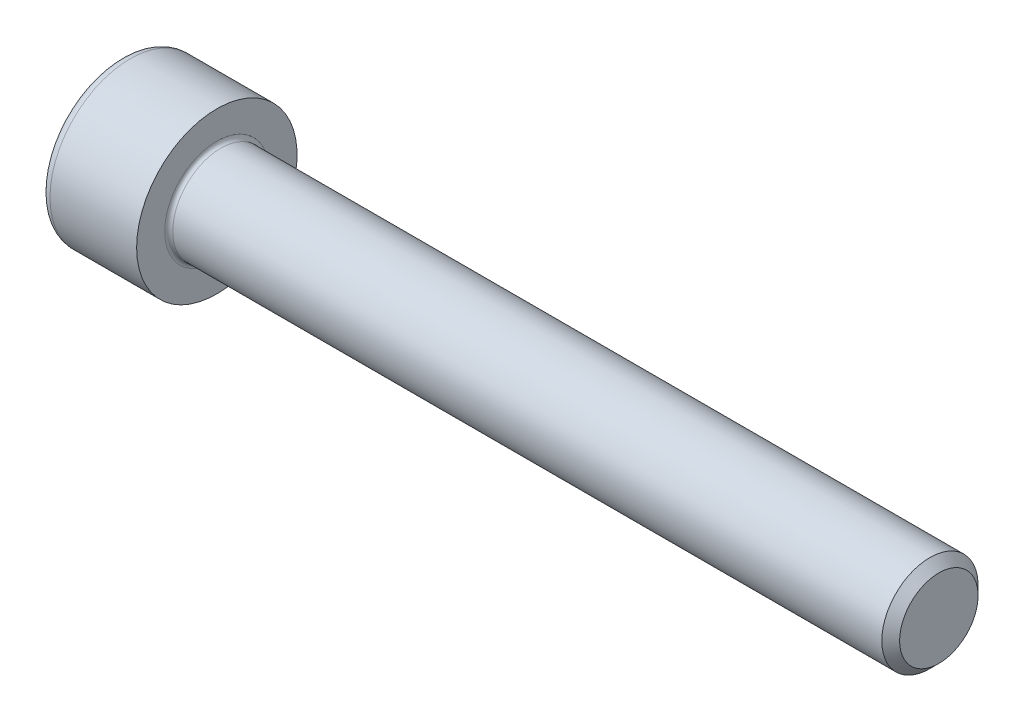
ISO-10303-21;
HEADER;
FILE_DESCRIPTION(('STEP AP214'),'2;1');
FILE_NAME('part.step','',(''),(''),'','','');
FILE_SCHEMA(('AUTOMOTIVE_DESIGN { 1 0 10303 214 1 1 1 1 }'));
ENDSEC;
DATA;
#1=APPLICATION_CONTEXT('core data for automotive mechanical design processes');
#2=APPLICATION_PROTOCOL_DEFINITION('international standard','automotive_design',2000,#1);
#3=PRODUCT_CONTEXT('',#1,'mechanical');
#4=PRODUCT('Part','Part','',(#3));
#5=PRODUCT_RELATED_PRODUCT_CATEGORY('part','',(#4));
#6=PRODUCT_DEFINITION_FORMATION('','',#4);
#7=PRODUCT_DEFINITION_CONTEXT('part definition',#1,'design');
#8=PRODUCT_DEFINITION('design','',#6,#7);
#9=PRODUCT_DEFINITION_SHAPE('','',#8);
#10=(LENGTH_UNIT() NAMED_UNIT(*) SI_UNIT(.MILLI.,.METRE.));
#11=(NAMED_UNIT(*) PLANE_ANGLE_UNIT() SI_UNIT($,.RADIAN.));
#12=(NAMED_UNIT(*) SI_UNIT($,.STERADIAN.) SOLID_ANGLE_UNIT());
#13=UNCERTAINTY_MEASURE_WITH_UNIT(LENGTH_MEASURE(1.E-05),#10,'distance_accuracy_value','');
#14=(GEOMETRIC_REPRESENTATION_CONTEXT(3) GLOBAL_UNCERTAINTY_ASSIGNED_CONTEXT((#13)) GLOBAL_UNIT_ASSIGNED_CONTEXT((#10,
#11,#12)) REPRESENTATION_CONTEXT('',''));
#15=CARTESIAN_POINT('',(0.,0.,0.));
#16=DIRECTION('',(0.,0.,1.));
#17=DIRECTION('',(1.,0.,0.));
#18=AXIS2_PLACEMENT_3D('',#15,#16,#17);
#19=CARTESIAN_POINT('',(0.,0.,0.));
#20=DIRECTION('',(-1.,0.,0.));
#21=DIRECTION('',(0.,0.,1.));
#22=AXIS2_PLACEMENT_3D('',#19,#20,#21);
#23=PLANE('',#22);
#24=DIRECTION('',(0.,-0.499999999999999,0.866025403784439));
#25=VECTOR('',#24,1.);
#26=CARTESIAN_POINT('',(0.,2.89829835133192,0.));
#27=LINE('',#26,#25);
#28=CARTESIAN_POINT('',(0.,2.89829835133192,0.));
#29=VERTEX_POINT('',#28);
#30=CARTESIAN_POINT('',(0.,1.44914917566596,2.51));
#31=VERTEX_POINT('',#30);
#32=EDGE_CURVE('E261',#29,#31,#27,.T.);
#33=ORIENTED_EDGE('',*,*,#32,.T.);
#34=DIRECTION('',(0.,1.,0.));
#35=VECTOR('',#34,1.);
#36=CARTESIAN_POINT('',(0.,-1.44914917566596,2.51));
#37=LINE('',#36,#35);
#38=CARTESIAN_POINT('',(0.,-1.44914917566596,2.51));
#39=VERTEX_POINT('',#38);
#40=EDGE_CURVE('E133',#39,#31,#37,.T.);
#41=ORIENTED_EDGE('',*,*,#40,.F.);
#42=DIRECTION('',(0.,-0.500000000000001,-0.866025403784438));
#43=VECTOR('',#42,1.);
#44=CARTESIAN_POINT('',(0.,-1.44914917566596,2.51));
#45=LINE('',#44,#43);
#46=CARTESIAN_POINT('',(0.,-2.89829835133193,0.));
#47=VERTEX_POINT('',#46);
#48=EDGE_CURVE('E264',#39,#47,#45,.T.);
#49=ORIENTED_EDGE('',*,*,#48,.T.);
#50=DIRECTION('',(0.,0.499999999999998,-0.86602540378444));
#51=VECTOR('',#50,1.);
#52=CARTESIAN_POINT('',(0.,-2.89829835133193,0.));
#53=LINE('',#52,#51);
#54=CARTESIAN_POINT('',(0.,-1.44914917566597,-2.51));
#55=VERTEX_POINT('',#54);
#56=EDGE_CURVE('E267',#47,#55,#53,.T.);
#57=ORIENTED_EDGE('',*,*,#56,.T.);
#58=DIRECTION('',(0.,-1.,0.));
#59=VECTOR('',#58,1.);
#60=CARTESIAN_POINT('',(0.,1.44914917566595,-2.51));
#61=LINE('',#60,#59);
#62=CARTESIAN_POINT('',(0.,1.44914917566595,-2.51));
#63=VERTEX_POINT('',#62);
#64=EDGE_CURVE('E270',#63,#55,#61,.T.);
#65=ORIENTED_EDGE('',*,*,#64,.F.);
#66=DIRECTION('',(0.,-0.500000000000001,-0.866025403784438));
#67=VECTOR('',#66,1.);
#68=CARTESIAN_POINT('',(0.,2.89829835133192,0.));
#69=LINE('',#68,#67);
#70=EDGE_CURVE('E128',#29,#63,#69,.T.);
#71=ORIENTED_EDGE('',*,*,#70,.F.);
#72=EDGE_LOOP('',(#33,#41,#49,#57,#65,#71));
#73=FACE_BOUND('',#72,.T.);
#74=CARTESIAN_POINT('',(0.,0.,0.));
#75=DIRECTION('',(-1.,0.,0.));
#76=DIRECTION('',(0.,0.,1.));
#77=AXIS2_PLACEMENT_3D('',#74,#75,#76);
#78=CIRCLE('',#77,4.4);
#79=CARTESIAN_POINT('',(0.,0.,4.4));
#80=VERTEX_POINT('',#79);
#81=EDGE_CURVE('E45',#80,#80,#78,.T.);
#82=ORIENTED_EDGE('',*,*,#81,.T.);
#83=EDGE_LOOP('',(#82));
#84=FACE_BOUND('',#83,.T.);
#85=ADVANCED_FACE('F37',(#73,#84),#23,.T.);
#86=CARTESIAN_POINT('',(-31.75,0.,0.));
#87=DIRECTION('',(-1.,0.,0.));
#88=DIRECTION('',(0.,0.,1.));
#89=AXIS2_PLACEMENT_3D('',#86,#87,#88);
#90=CYLINDRICAL_SURFACE('',#89,5.);
#91=CARTESIAN_POINT('',(0.600000000000003,0.,0.));
#92=DIRECTION('',(-1.,0.,0.));
#93=DIRECTION('',(0.,0.,1.));
#94=AXIS2_PLACEMENT_3D('',#91,#92,#93);
#95=CIRCLE('',#94,5.);
#96=CARTESIAN_POINT('',(0.600000000000003,0.,5.));
#97=VERTEX_POINT('',#96);
#98=EDGE_CURVE('E11',#97,#97,#95,.F.);
#99=ORIENTED_EDGE('',*,*,#98,.T.);
#100=EDGE_LOOP('',(#99));
#101=FACE_BOUND('',#100,.T.);
#102=CARTESIAN_POINT('',(6.,0.,0.));
#103=DIRECTION('',(-1.,0.,0.));
#104=DIRECTION('',(0.,0.,1.));
#105=AXIS2_PLACEMENT_3D('',#102,#103,#104);
#106=CIRCLE('',#105,5.);
#107=CARTESIAN_POINT('',(6.,0.,5.));
#108=VERTEX_POINT('',#107);
#109=EDGE_CURVE('E151',#108,#108,#106,.T.);
#110=ORIENTED_EDGE('',*,*,#109,.T.);
#111=EDGE_LOOP('',(#110));
#112=FACE_BOUND('',#111,.T.);
#113=ADVANCED_FACE('F175',(#101,#112),#90,.T.);
#114=CARTESIAN_POINT('',(6.,5.,0.));
#115=DIRECTION('',(1.,0.,0.));
#116=DIRECTION('',(0.,0.,-1.));
#117=AXIS2_PLACEMENT_3D('',#114,#115,#116);
#118=PLANE('',#117);
#119=CARTESIAN_POINT('',(6.,0.,0.));
#120=DIRECTION('',(1.,0.,0.));
#121=DIRECTION('',(0.,0.,-1.));
#122=AXIS2_PLACEMENT_3D('',#119,#120,#121);
#123=CIRCLE('',#122,3.24999999999999);
#124=CARTESIAN_POINT('',(6.,0.,-3.24999999999999));
#125=VERTEX_POINT('',#124);
#126=EDGE_CURVE('E154',#125,#125,#123,.F.);
#127=ORIENTED_EDGE('',*,*,#126,.T.);
#128=EDGE_LOOP('',(#127));
#129=FACE_BOUND('',#128,.T.);
#130=ORIENTED_EDGE('',*,*,#109,.F.);
#131=EDGE_LOOP('',(#130));
#132=FACE_BOUND('',#131,.T.);
#133=ADVANCED_FACE('F181',(#129,#132),#118,.T.);
#134=CARTESIAN_POINT('',(-31.75,0.,0.));
#135=DIRECTION('',(-1.,0.,0.));
#136=DIRECTION('',(0.,0.,1.));
#137=AXIS2_PLACEMENT_3D('',#134,#135,#136);
#138=CYLINDRICAL_SURFACE('',#137,2.99999999999999);
#139=CARTESIAN_POINT('',(6.25,0.,0.));
#140=DIRECTION('',(1.,0.,0.));
#141=DIRECTION('',(0.,0.,-1.));
#142=AXIS2_PLACEMENT_3D('',#139,#140,#141);
#143=CIRCLE('',#142,2.99999999999999);
#144=CARTESIAN_POINT('',(6.25,0.,-2.99999999999999));
#145=VERTEX_POINT('',#144);
#146=EDGE_CURVE('E157',#145,#145,#143,.T.);
#147=ORIENTED_EDGE('',*,*,#146,.T.);
#148=EDGE_LOOP('',(#147));
#149=FACE_BOUND('',#148,.T.);
#150=CARTESIAN_POINT('',(50.4455,0.,0.));
#151=DIRECTION('',(-1.,0.,0.));
#152=DIRECTION('',(0.,0.,1.));
#153=AXIS2_PLACEMENT_3D('',#150,#151,#152);
#154=CIRCLE('',#153,2.99999999999999);
#155=CARTESIAN_POINT('',(50.4455,0.,2.99999999999999));
#156=VERTEX_POINT('',#155);
#157=EDGE_CURVE('E148',#156,#156,#154,.T.);
#158=ORIENTED_EDGE('',*,*,#157,.T.);
#159=EDGE_LOOP('',(#158));
#160=FACE_BOUND('',#159,.T.);
#161=ADVANCED_FACE('F187',(#149,#160),#138,.T.);
#162=CARTESIAN_POINT('',(51.,0.,0.));
#163=DIRECTION('',(-1.,0.,0.));
#164=DIRECTION('',(0.,0.,1.));
#165=AXIS2_PLACEMENT_3D('',#162,#163,#164);
#166=CONICAL_SURFACE('',#165,2.4455,0.785398163397424);
#167=ORIENTED_EDGE('',*,*,#157,.F.);
#168=EDGE_LOOP('',(#167));
#169=FACE_BOUND('',#168,.T.);
#170=CARTESIAN_POINT('',(51.,0.,0.));
#171=DIRECTION('',(-1.,0.,0.));
#172=DIRECTION('',(0.,0.,1.));
#173=AXIS2_PLACEMENT_3D('',#170,#171,#172);
#174=CIRCLE('',#173,2.4455);
#175=CARTESIAN_POINT('',(51.,0.,2.4455));
#176=VERTEX_POINT('',#175);
#177=EDGE_CURVE('E144',#176,#176,#174,.T.);
#178=ORIENTED_EDGE('',*,*,#177,.T.);
#179=EDGE_LOOP('',(#178));
#180=FACE_BOUND('',#179,.T.);
#181=ADVANCED_FACE('F191',(#169,#180),#166,.T.);
#182=CARTESIAN_POINT('',(51.,2.4455,0.));
#183=DIRECTION('',(1.,0.,0.));
#184=DIRECTION('',(0.,0.,-1.));
#185=AXIS2_PLACEMENT_3D('',#182,#183,#184);
#186=PLANE('',#185);
#187=ORIENTED_EDGE('',*,*,#177,.F.);
#188=EDGE_LOOP('',(#187));
#189=FACE_BOUND('',#188,.T.);
#190=ADVANCED_FACE('F171',(#189),#186,.T.);
#191=CARTESIAN_POINT('',(6.25,0.,0.));
#192=DIRECTION('',(1.,0.,0.));
#193=DIRECTION('',(0.,0.,-1.));
#194=AXIS2_PLACEMENT_3D('',#191,#192,#193);
#195=TOROIDAL_SURFACE('',#194,3.24999999999999,0.25);
#196=ORIENTED_EDGE('',*,*,#146,.F.);
#197=EDGE_LOOP('',(#196));
#198=FACE_BOUND('',#197,.T.);
#199=ORIENTED_EDGE('',*,*,#126,.F.);
#200=EDGE_LOOP('',(#199));
#201=FACE_BOUND('',#200,.T.);
#202=ADVANCED_FACE('F164',(#198,#201),#195,.F.);
#203=CARTESIAN_POINT('',(0.600000000000003,0.,0.));
#204=DIRECTION('',(-1.,0.,0.));
#205=DIRECTION('',(0.,0.,1.));
#206=AXIS2_PLACEMENT_3D('',#203,#204,#205);
#207=TOROIDAL_SURFACE('',#206,4.4,0.6);
#208=ORIENTED_EDGE('',*,*,#98,.F.);
#209=EDGE_LOOP('',(#208));
#210=FACE_BOUND('',#209,.T.);
#211=ORIENTED_EDGE('',*,*,#81,.F.);
#212=EDGE_LOOP('',(#211));
#213=FACE_BOUND('',#212,.T.);
#214=ADVANCED_FACE('F39',(#210,#213),#207,.T.);
#215=CARTESIAN_POINT('',(3.,2.89829835133192,0.));
#216=DIRECTION('',(0.,-0.866025403784439,-0.499999999999998));
#217=DIRECTION('',(0.,0.499999999999999,-0.86602540378444));
#218=AXIS2_PLACEMENT_3D('',#215,#216,#217);
#219=PLANE('',#218);
#220=ORIENTED_EDGE('',*,*,#32,.F.);
#221=DIRECTION('',(-1.,0.,0.));
#222=VECTOR('',#221,1.);
#223=CARTESIAN_POINT('',(3.,2.89829835133192,0.));
#224=LINE('',#223,#222);
#225=CARTESIAN_POINT('',(3.,2.89829835133192,0.));
#226=VERTEX_POINT('',#225);
#227=EDGE_CURVE('E251',#226,#29,#224,.T.);
#228=ORIENTED_EDGE('',*,*,#227,.F.);
#229=DIRECTION('',(0.,-0.499999999999999,0.866025403784439));
#230=VECTOR('',#229,1.);
#231=CARTESIAN_POINT('',(3.,2.89829835133192,0.));
#232=LINE('',#231,#230);
#233=CARTESIAN_POINT('',(3.,2.17372376349894,1.25499999999999));
#234=VERTEX_POINT('',#233);
#235=EDGE_CURVE('E120',#226,#234,#232,.T.);
#236=ORIENTED_EDGE('',*,*,#235,.T.);
#237=CARTESIAN_POINT('',(3.,1.44914917566596,2.51));
#238=VERTEX_POINT('',#237);
#239=EDGE_CURVE('E111',#234,#238,#232,.T.);
#240=ORIENTED_EDGE('',*,*,#239,.T.);
#241=DIRECTION('',(-1.,0.,0.));
#242=VECTOR('',#241,1.);
#243=CARTESIAN_POINT('',(3.,1.44914917566596,2.51));
#244=LINE('',#243,#242);
#245=EDGE_CURVE('E125',#238,#31,#244,.T.);
#246=ORIENTED_EDGE('',*,*,#245,.T.);
#247=EDGE_LOOP('',(#220,#228,#236,#240,#246));
#248=FACE_BOUND('',#247,.T.);
#249=ADVANCED_FACE('F124',(#248),#219,.T.);
#250=CARTESIAN_POINT('',(3.,-1.44914917566596,2.51));
#251=DIRECTION('',(0.,0.,1.));
#252=DIRECTION('',(0.,-1.,0.));
#253=AXIS2_PLACEMENT_3D('',#250,#251,#252);
#254=PLANE('',#253);
#255=ORIENTED_EDGE('',*,*,#40,.T.);
#256=ORIENTED_EDGE('',*,*,#245,.F.);
#257=DIRECTION('',(0.,1.,0.));
#258=VECTOR('',#257,1.);
#259=CARTESIAN_POINT('',(3.,-1.44914917566596,2.51));
#260=LINE('',#259,#258);
#261=CARTESIAN_POINT('',(3.,0.,2.51));
#262=VERTEX_POINT('',#261);
#263=EDGE_CURVE('E108',#262,#238,#260,.T.);
#264=ORIENTED_EDGE('',*,*,#263,.F.);
#265=CARTESIAN_POINT('',(3.,-1.44914917566596,2.51));
#266=VERTEX_POINT('',#265);
#267=EDGE_CURVE('E119',#266,#262,#260,.T.);
#268=ORIENTED_EDGE('',*,*,#267,.F.);
#269=DIRECTION('',(-1.,0.,0.));
#270=VECTOR('',#269,1.);
#271=CARTESIAN_POINT('',(3.,-1.44914917566596,2.51));
#272=LINE('',#271,#270);
#273=EDGE_CURVE('E135',#266,#39,#272,.T.);
#274=ORIENTED_EDGE('',*,*,#273,.T.);
#275=EDGE_LOOP('',(#255,#256,#264,#268,#274));
#276=FACE_BOUND('',#275,.T.);
#277=ADVANCED_FACE('F130',(#276),#254,.F.);
#278=CARTESIAN_POINT('',(3.,-1.44914917566596,2.51));
#279=DIRECTION('',(0.,0.866025403784438,-0.500000000000001));
#280=DIRECTION('',(0.,0.500000000000001,0.866025403784438));
#281=AXIS2_PLACEMENT_3D('',#278,#279,#280);
#282=PLANE('',#281);
#283=ORIENTED_EDGE('',*,*,#48,.F.);
#284=ORIENTED_EDGE('',*,*,#273,.F.);
#285=DIRECTION('',(0.,-0.500000000000001,-0.866025403784438));
#286=VECTOR('',#285,1.);
#287=CARTESIAN_POINT('',(3.,-1.44914917566596,2.51));
#288=LINE('',#287,#286);
#289=CARTESIAN_POINT('',(3.,-2.17372376349895,1.25500000000001));
#290=VERTEX_POINT('',#289);
#291=EDGE_CURVE('E290',#266,#290,#288,.T.);
#292=ORIENTED_EDGE('',*,*,#291,.T.);
#293=CARTESIAN_POINT('',(3.,-2.89829835133193,0.));
#294=VERTEX_POINT('',#293);
#295=EDGE_CURVE('E279',#290,#294,#288,.T.);
#296=ORIENTED_EDGE('',*,*,#295,.T.);
#297=DIRECTION('',(-1.,0.,0.));
#298=VECTOR('',#297,1.);
#299=CARTESIAN_POINT('',(3.,-2.89829835133193,0.));
#300=LINE('',#299,#298);
#301=EDGE_CURVE('E140',#294,#47,#300,.T.);
#302=ORIENTED_EDGE('',*,*,#301,.T.);
#303=EDGE_LOOP('',(#283,#284,#292,#296,#302));
#304=FACE_BOUND('',#303,.T.);
#305=ADVANCED_FACE('F205',(#304),#282,.T.);
#306=CARTESIAN_POINT('',(3.,-2.89829835133193,0.));
#307=DIRECTION('',(0.,0.86602540378444,0.499999999999998));
#308=DIRECTION('',(0.,-0.499999999999998,0.86602540378444));
#309=AXIS2_PLACEMENT_3D('',#306,#307,#308);
#310=PLANE('',#309);
#311=ORIENTED_EDGE('',*,*,#56,.F.);
#312=ORIENTED_EDGE('',*,*,#301,.F.);
#313=DIRECTION('',(0.,0.499999999999998,-0.86602540378444));
#314=VECTOR('',#313,1.);
#315=CARTESIAN_POINT('',(3.,-2.89829835133193,0.));
#316=LINE('',#315,#314);
#317=CARTESIAN_POINT('',(3.,-2.17372376349895,-1.255));
#318=VERTEX_POINT('',#317);
#319=EDGE_CURVE('E257',#294,#318,#316,.T.);
#320=ORIENTED_EDGE('',*,*,#319,.T.);
#321=CARTESIAN_POINT('',(3.,-1.44914917566597,-2.51));
#322=VERTEX_POINT('',#321);
#323=EDGE_CURVE('E289',#318,#322,#316,.T.);
#324=ORIENTED_EDGE('',*,*,#323,.T.);
#325=DIRECTION('',(-1.,0.,0.));
#326=VECTOR('',#325,1.);
#327=CARTESIAN_POINT('',(3.,-1.44914917566597,-2.51));
#328=LINE('',#327,#326);
#329=EDGE_CURVE('E250',#322,#55,#328,.T.);
#330=ORIENTED_EDGE('',*,*,#329,.T.);
#331=EDGE_LOOP('',(#311,#312,#320,#324,#330));
#332=FACE_BOUND('',#331,.T.);
#333=ADVANCED_FACE('F208',(#332),#310,.T.);
#334=CARTESIAN_POINT('',(3.,1.44914917566595,-2.51));
#335=DIRECTION('',(0.,0.,-1.));
#336=DIRECTION('',(0.,1.,0.));
#337=AXIS2_PLACEMENT_3D('',#334,#335,#336);
#338=PLANE('',#337);
#339=ORIENTED_EDGE('',*,*,#64,.T.);
#340=ORIENTED_EDGE('',*,*,#329,.F.);
#341=DIRECTION('',(0.,-1.,0.));
#342=VECTOR('',#341,1.);
#343=CARTESIAN_POINT('',(3.,1.44914917566595,-2.51));
#344=LINE('',#343,#342);
#345=CARTESIAN_POINT('',(3.,0.,-2.51));
#346=VERTEX_POINT('',#345);
#347=EDGE_CURVE('E254',#346,#322,#344,.T.);
#348=ORIENTED_EDGE('',*,*,#347,.F.);
#349=CARTESIAN_POINT('',(3.,1.44914917566595,-2.51));
#350=VERTEX_POINT('',#349);
#351=EDGE_CURVE('E52',#350,#346,#344,.T.);
#352=ORIENTED_EDGE('',*,*,#351,.F.);
#353=DIRECTION('',(-1.,0.,0.));
#354=VECTOR('',#353,1.);
#355=CARTESIAN_POINT('',(3.,1.44914917566595,-2.51));
#356=LINE('',#355,#354);
#357=EDGE_CURVE('E247',#350,#63,#356,.T.);
#358=ORIENTED_EDGE('',*,*,#357,.T.);
#359=EDGE_LOOP('',(#339,#340,#348,#352,#358));
#360=FACE_BOUND('',#359,.T.);
#361=ADVANCED_FACE('F212',(#360),#338,.F.);
#362=CARTESIAN_POINT('',(3.,2.89829835133192,0.));
#363=DIRECTION('',(0.,0.866025403784438,-0.500000000000001));
#364=DIRECTION('',(0.,0.500000000000001,0.866025403784438));
#365=AXIS2_PLACEMENT_3D('',#362,#363,#364);
#366=PLANE('',#365);
#367=ORIENTED_EDGE('',*,*,#70,.T.);
#368=ORIENTED_EDGE('',*,*,#357,.F.);
#369=DIRECTION('',(0.,-0.500000000000001,-0.866025403784438));
#370=VECTOR('',#369,1.);
#371=CARTESIAN_POINT('',(3.,2.89829835133192,0.));
#372=LINE('',#371,#370);
#373=CARTESIAN_POINT('',(3.,2.17372376349894,-1.255));
#374=VERTEX_POINT('',#373);
#375=EDGE_CURVE('E237',#374,#350,#372,.T.);
#376=ORIENTED_EDGE('',*,*,#375,.F.);
#377=EDGE_CURVE('E243',#226,#374,#372,.T.);
#378=ORIENTED_EDGE('',*,*,#377,.F.);
#379=ORIENTED_EDGE('',*,*,#227,.T.);
#380=EDGE_LOOP('',(#367,#368,#376,#378,#379));
#381=FACE_BOUND('',#380,.T.);
#382=ADVANCED_FACE('F216',(#381),#366,.F.);
#383=CARTESIAN_POINT('',(3.,4.34744752699787,-2.51000000000001));
#384=DIRECTION('',(1.,0.,0.));
#385=DIRECTION('',(0.,0.,-1.));
#386=AXIS2_PLACEMENT_3D('',#383,#384,#385);
#387=PLANE('',#386);
#388=ORIENTED_EDGE('',*,*,#347,.T.);
#389=ORIENTED_EDGE('',*,*,#323,.F.);
#390=CARTESIAN_POINT('',(3.,0.,0.));
#391=DIRECTION('',(-1.,0.,0.));
#392=DIRECTION('',(0.,0.,1.));
#393=AXIS2_PLACEMENT_3D('',#390,#391,#392);
#394=CIRCLE('',#393,2.51);
#395=EDGE_CURVE('E285',#346,#318,#394,.T.);
#396=ORIENTED_EDGE('',*,*,#395,.F.);
#397=EDGE_LOOP('',(#388,#389,#396));
#398=FACE_BOUND('',#397,.T.);
#399=ADVANCED_FACE('F220',(#398),#387,.F.);
#400=ORIENTED_EDGE('',*,*,#319,.F.);
#401=ORIENTED_EDGE('',*,*,#295,.F.);
#402=EDGE_CURVE('E138',#318,#290,#394,.T.);
#403=ORIENTED_EDGE('',*,*,#402,.F.);
#404=EDGE_LOOP('',(#400,#401,#403));
#405=FACE_BOUND('',#404,.T.);
#406=ADVANCED_FACE('F223',(#405),#387,.F.);
#407=ORIENTED_EDGE('',*,*,#291,.F.);
#408=ORIENTED_EDGE('',*,*,#267,.T.);
#409=EDGE_CURVE('E134',#290,#262,#394,.T.);
#410=ORIENTED_EDGE('',*,*,#409,.F.);
#411=EDGE_LOOP('',(#407,#408,#410));
#412=FACE_BOUND('',#411,.T.);
#413=ADVANCED_FACE('F228',(#412),#387,.F.);
#414=ORIENTED_EDGE('',*,*,#263,.T.);
#415=ORIENTED_EDGE('',*,*,#239,.F.);
#416=EDGE_CURVE('E114',#262,#234,#394,.T.);
#417=ORIENTED_EDGE('',*,*,#416,.F.);
#418=EDGE_LOOP('',(#414,#415,#417));
#419=FACE_BOUND('',#418,.T.);
#420=ADVANCED_FACE('F110',(#419),#387,.F.);
#421=ORIENTED_EDGE('',*,*,#235,.F.);
#422=ORIENTED_EDGE('',*,*,#377,.T.);
#423=EDGE_CURVE('E145',#234,#374,#394,.T.);
#424=ORIENTED_EDGE('',*,*,#423,.F.);
#425=EDGE_LOOP('',(#421,#422,#424));
#426=FACE_BOUND('',#425,.T.);
#427=ADVANCED_FACE('F231',(#426),#387,.F.);
#428=ORIENTED_EDGE('',*,*,#375,.T.);
#429=ORIENTED_EDGE('',*,*,#351,.T.);
#430=EDGE_CURVE('E240',#374,#346,#394,.T.);
#431=ORIENTED_EDGE('',*,*,#430,.F.);
#432=EDGE_LOOP('',(#428,#429,#431));
#433=FACE_BOUND('',#432,.T.);
#434=ADVANCED_FACE('F201',(#433),#387,.F.);
#435=CARTESIAN_POINT('',(3.,0.,0.));
#436=DIRECTION('',(-1.,0.,0.));
#437=DIRECTION('',(0.,0.,1.));
#438=AXIS2_PLACEMENT_3D('',#435,#436,#437);
#439=CONICAL_SURFACE('',#438,2.51,1.04719755119659);
#440=CARTESIAN_POINT('',(4.44914917566598,0.,0.));
#441=VERTEX_POINT('',#440);
#442=VERTEX_LOOP('',#441);
#443=FACE_BOUND('',#442,.T.);
#444=ORIENTED_EDGE('',*,*,#416,.T.);
#445=ORIENTED_EDGE('',*,*,#423,.T.);
#446=ORIENTED_EDGE('',*,*,#430,.T.);
#447=ORIENTED_EDGE('',*,*,#395,.T.);
#448=ORIENTED_EDGE('',*,*,#402,.T.);
#449=ORIENTED_EDGE('',*,*,#409,.T.);
#450=EDGE_LOOP('',(#444,#445,#446,#447,#448,#449));
#451=FACE_BOUND('',#450,.T.);
#452=ADVANCED_FACE('F199',(#443,#451),#439,.F.);
#453=CLOSED_SHELL('',(#85,#113,#133,#161,#181,#190,#202,#214,#249,#277,#305,#333,#361,#382,#399,
#406,#413,#420,#427,#434,#452));
#454=MANIFOLD_SOLID_BREP('B2',#453);
#455=ADVANCED_BREP_SHAPE_REPRESENTATION('',(#18,#454),#14);
#456=SHAPE_DEFINITION_REPRESENTATION(#9,#455);
ENDSEC;
END-ISO-10303-21;
